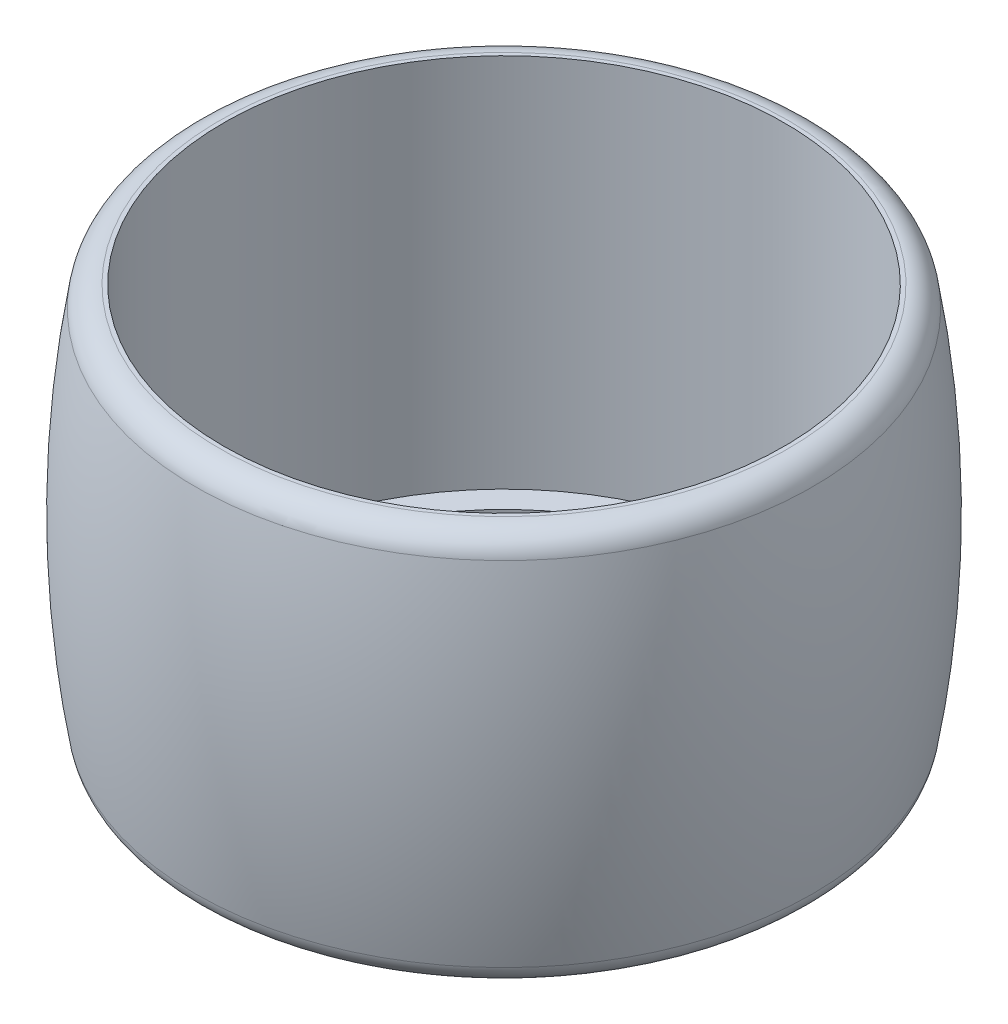
ISO-10303-21;
HEADER;
FILE_DESCRIPTION(('STEP AP214'),'2;1');
FILE_NAME('part.step','',(''),(''),'','','');
FILE_SCHEMA(('AUTOMOTIVE_DESIGN { 1 0 10303 214 1 1 1 1 }'));
ENDSEC;
DATA;
#1=APPLICATION_CONTEXT('core data for automotive mechanical design processes');
#2=APPLICATION_PROTOCOL_DEFINITION('international standard','automotive_design',2000,#1);
#3=PRODUCT_CONTEXT('',#1,'mechanical');
#4=PRODUCT('Part','Part','',(#3));
#5=PRODUCT_RELATED_PRODUCT_CATEGORY('part','',(#4));
#6=PRODUCT_DEFINITION_FORMATION('','',#4);
#7=PRODUCT_DEFINITION_CONTEXT('part definition',#1,'design');
#8=PRODUCT_DEFINITION('design','',#6,#7);
#9=PRODUCT_DEFINITION_SHAPE('','',#8);
#10=(LENGTH_UNIT() NAMED_UNIT(*) SI_UNIT(.MILLI.,.METRE.));
#11=(NAMED_UNIT(*) PLANE_ANGLE_UNIT() SI_UNIT($,.RADIAN.));
#12=(NAMED_UNIT(*) SI_UNIT($,.STERADIAN.) SOLID_ANGLE_UNIT());
#13=UNCERTAINTY_MEASURE_WITH_UNIT(LENGTH_MEASURE(1.E-05),#10,'distance_accuracy_value','');
#14=(GEOMETRIC_REPRESENTATION_CONTEXT(3) GLOBAL_UNCERTAINTY_ASSIGNED_CONTEXT((#13)) GLOBAL_UNIT_ASSIGNED_CONTEXT((#10,
#11,#12)) REPRESENTATION_CONTEXT('',''));
#15=CARTESIAN_POINT('',(0.,0.,0.));
#16=DIRECTION('',(0.,0.,1.));
#17=DIRECTION('',(1.,0.,0.));
#18=AXIS2_PLACEMENT_3D('',#15,#16,#17);
#19=CARTESIAN_POINT('',(0.,7.38603036951855,0.));
#20=DIRECTION('',(0.,1.,0.));
#21=DIRECTION('',(0.,0.,1.));
#22=AXIS2_PLACEMENT_3D('',#19,#20,#21);
#23=CYLINDRICAL_SURFACE('',#22,20.55);
#24=CARTESIAN_POINT('',(0.,-15.85,0.));
#25=DIRECTION('',(0.,1.,0.));
#26=DIRECTION('',(0.,0.,1.));
#27=AXIS2_PLACEMENT_3D('',#24,#25,#26);
#28=CIRCLE('',#27,20.55);
#29=CARTESIAN_POINT('',(0.,-15.85,20.55));
#30=VERTEX_POINT('',#29);
#31=EDGE_CURVE('E79',#30,#30,#28,.T.);
#32=ORIENTED_EDGE('',*,*,#31,.F.);
#33=EDGE_LOOP('',(#32));
#34=FACE_BOUND('',#33,.T.);
#35=CARTESIAN_POINT('',(0.,-14.35,0.));
#36=DIRECTION('',(0.,1.,0.));
#37=DIRECTION('',(0.,0.,1.));
#38=AXIS2_PLACEMENT_3D('',#35,#36,#37);
#39=CIRCLE('',#38,20.55);
#40=CARTESIAN_POINT('',(0.,-14.35,20.55));
#41=VERTEX_POINT('',#40);
#42=EDGE_CURVE('E67',#41,#41,#39,.T.);
#43=ORIENTED_EDGE('',*,*,#42,.T.);
#44=EDGE_LOOP('',(#43));
#45=FACE_BOUND('',#44,.T.);
#46=ADVANCED_FACE('F43',(#34,#45),#23,.F.);
#47=CARTESIAN_POINT('',(20.55,-14.35,0.));
#48=DIRECTION('',(0.,-1.,0.));
#49=DIRECTION('',(0.,0.,-1.));
#50=AXIS2_PLACEMENT_3D('',#47,#48,#49);
#51=PLANE('',#50);
#52=ORIENTED_EDGE('',*,*,#42,.F.);
#53=EDGE_LOOP('',(#52));
#54=FACE_BOUND('',#53,.T.);
#55=CARTESIAN_POINT('',(0.,-14.35,0.));
#56=DIRECTION('',(0.,1.,0.));
#57=DIRECTION('',(0.,0.,1.));
#58=AXIS2_PLACEMENT_3D('',#55,#56,#57);
#59=CIRCLE('',#58,22.55);
#60=CARTESIAN_POINT('',(0.,-14.35,22.55));
#61=VERTEX_POINT('',#60);
#62=EDGE_CURVE('E71',#61,#61,#59,.T.);
#63=ORIENTED_EDGE('',*,*,#62,.T.);
#64=EDGE_LOOP('',(#63));
#65=FACE_BOUND('',#64,.T.);
#66=ADVANCED_FACE('F88',(#54,#65),#51,.F.);
#67=CARTESIAN_POINT('',(0.,7.38603036951855,0.));
#68=DIRECTION('',(0.,1.,0.));
#69=DIRECTION('',(0.,0.,1.));
#70=AXIS2_PLACEMENT_3D('',#67,#68,#69);
#71=CYLINDRICAL_SURFACE('',#70,22.55);
#72=ORIENTED_EDGE('',*,*,#62,.F.);
#73=EDGE_LOOP('',(#72));
#74=FACE_BOUND('',#73,.T.);
#75=CARTESIAN_POINT('',(0.,15.85,0.));
#76=DIRECTION('',(0.,1.,0.));
#77=DIRECTION('',(0.,0.,1.));
#78=AXIS2_PLACEMENT_3D('',#75,#76,#77);
#79=CIRCLE('',#78,22.55);
#80=CARTESIAN_POINT('',(0.,15.85,22.55));
#81=VERTEX_POINT('',#80);
#82=EDGE_CURVE('E75',#81,#81,#79,.T.);
#83=ORIENTED_EDGE('',*,*,#82,.T.);
#84=EDGE_LOOP('',(#83));
#85=FACE_BOUND('',#84,.T.);
#86=ADVANCED_FACE('F94',(#74,#85),#71,.F.);
#87=CARTESIAN_POINT('',(22.55,15.85,0.));
#88=DIRECTION('',(0.,-1.,0.));
#89=DIRECTION('',(0.,0.,-1.));
#90=AXIS2_PLACEMENT_3D('',#87,#88,#89);
#91=PLANE('',#90);
#92=CARTESIAN_POINT('',(0.,15.85,0.));
#93=DIRECTION('',(0.,-1.,0.));
#94=DIRECTION('',(0.,0.,-1.));
#95=AXIS2_PLACEMENT_3D('',#92,#93,#94);
#96=CIRCLE('',#95,22.8734651926495);
#97=CARTESIAN_POINT('',(0.,15.85,-22.8734651926495));
#98=VERTEX_POINT('',#97);
#99=EDGE_CURVE('E10',#98,#98,#96,.F.);
#100=ORIENTED_EDGE('',*,*,#99,.T.);
#101=EDGE_LOOP('',(#100));
#102=FACE_BOUND('',#101,.T.);
#103=ORIENTED_EDGE('',*,*,#82,.F.);
#104=EDGE_LOOP('',(#103));
#105=FACE_BOUND('',#104,.T.);
#106=ADVANCED_FACE('F100',(#102,#105),#91,.F.);
#107=CARTESIAN_POINT('',(0.,0.,0.));
#108=DIRECTION('',(0.,1.,0.));
#109=DIRECTION('',(0.,0.,1.));
#110=AXIS2_PLACEMENT_3D('',#107,#108,#109);
#111=DEGENERATE_TOROIDAL_SURFACE('',#110,60.,86.0228167406764,.F.);
#112=CARTESIAN_POINT('',(0.,-14.1796723565635,0.));
#113=DIRECTION('',(0.,1.,0.));
#114=DIRECTION('',(0.,0.,1.));
#115=AXIS2_PLACEMENT_3D('',#112,#113,#114);
#116=CIRCLE('',#115,24.8461071108186);
#117=CARTESIAN_POINT('',(0.,-14.1796723565635,24.8461071108186));
#118=VERTEX_POINT('',#117);
#119=EDGE_CURVE('E56',#118,#118,#116,.T.);
#120=ORIENTED_EDGE('',*,*,#119,.T.);
#121=EDGE_LOOP('',(#120));
#122=FACE_BOUND('',#121,.T.);
#123=CARTESIAN_POINT('',(0.,14.1796723565635,0.));
#124=DIRECTION('',(0.,-1.,0.));
#125=DIRECTION('',(0.,0.,-1.));
#126=AXIS2_PLACEMENT_3D('',#123,#124,#125);
#127=CIRCLE('',#126,24.8461071108186);
#128=CARTESIAN_POINT('',(0.,14.1796723565635,-24.8461071108186));
#129=VERTEX_POINT('',#128);
#130=EDGE_CURVE('E61',#129,#129,#127,.T.);
#131=ORIENTED_EDGE('',*,*,#130,.T.);
#132=EDGE_LOOP('',(#131));
#133=FACE_BOUND('',#132,.T.);
#134=ADVANCED_FACE('F105',(#122,#133),#111,.F.);
#135=CARTESIAN_POINT('',(24.55,-15.85,0.));
#136=DIRECTION('',(0.,1.,0.));
#137=DIRECTION('',(0.,0.,1.));
#138=AXIS2_PLACEMENT_3D('',#135,#136,#137);
#139=PLANE('',#138);
#140=CARTESIAN_POINT('',(0.,-15.85,0.));
#141=DIRECTION('',(0.,1.,0.));
#142=DIRECTION('',(0.,0.,1.));
#143=AXIS2_PLACEMENT_3D('',#140,#141,#142);
#144=CIRCLE('',#143,22.8734651926495);
#145=CARTESIAN_POINT('',(0.,-15.85,22.8734651926495));
#146=VERTEX_POINT('',#145);
#147=EDGE_CURVE('E51',#146,#146,#144,.F.);
#148=ORIENTED_EDGE('',*,*,#147,.T.);
#149=EDGE_LOOP('',(#148));
#150=FACE_BOUND('',#149,.T.);
#151=ORIENTED_EDGE('',*,*,#31,.T.);
#152=EDGE_LOOP('',(#151));
#153=FACE_BOUND('',#152,.T.);
#154=ADVANCED_FACE('F84',(#150,#153),#139,.F.);
#155=CARTESIAN_POINT('',(0.,-13.85,0.));
#156=DIRECTION('',(0.,1.,0.));
#157=DIRECTION('',(0.,0.,1.));
#158=AXIS2_PLACEMENT_3D('',#155,#156,#157);
#159=TOROIDAL_SURFACE('',#158,22.8734651926495,2.);
#160=ORIENTED_EDGE('',*,*,#147,.F.);
#161=EDGE_LOOP('',(#160));
#162=FACE_BOUND('',#161,.T.);
#163=ORIENTED_EDGE('',*,*,#119,.F.);
#164=EDGE_LOOP('',(#163));
#165=FACE_BOUND('',#164,.T.);
#166=ADVANCED_FACE('F113',(#162,#165),#159,.T.);
#167=CARTESIAN_POINT('',(0.,13.85,0.));
#168=DIRECTION('',(0.,-1.,0.));
#169=DIRECTION('',(0.,0.,-1.));
#170=AXIS2_PLACEMENT_3D('',#167,#168,#169);
#171=TOROIDAL_SURFACE('',#170,22.8734651926495,2.);
#172=ORIENTED_EDGE('',*,*,#130,.F.);
#173=EDGE_LOOP('',(#172));
#174=FACE_BOUND('',#173,.T.);
#175=ORIENTED_EDGE('',*,*,#99,.F.);
#176=EDGE_LOOP('',(#175));
#177=FACE_BOUND('',#176,.T.);
#178=ADVANCED_FACE('F45',(#174,#177),#171,.T.);
#179=CLOSED_SHELL('',(#46,#66,#86,#106,#134,#154,#166,#178));
#180=MANIFOLD_SOLID_BREP('B2',#179);
#181=ADVANCED_BREP_SHAPE_REPRESENTATION('',(#18,#180),#14);
#182=SHAPE_DEFINITION_REPRESENTATION(#9,#181);
ENDSEC;
END-ISO-10303-21;
